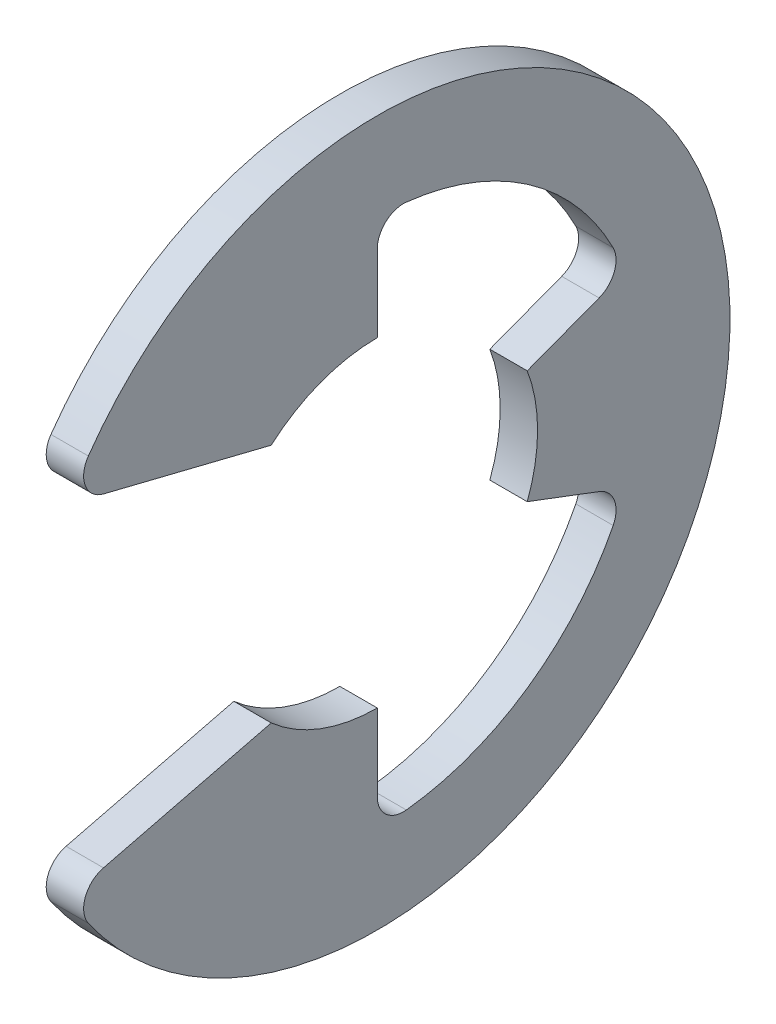
ISO-10303-21;
HEADER;
FILE_DESCRIPTION(('STEP AP214'),'2;1');
FILE_NAME('part.step','',(''),(''),'','','');
FILE_SCHEMA(('AUTOMOTIVE_DESIGN { 1 0 10303 214 1 1 1 1 }'));
ENDSEC;
DATA;
#1=APPLICATION_CONTEXT('core data for automotive mechanical design processes');
#2=APPLICATION_PROTOCOL_DEFINITION('international standard','automotive_design',2000,#1);
#3=PRODUCT_CONTEXT('',#1,'mechanical');
#4=PRODUCT('Part','Part','',(#3));
#5=PRODUCT_RELATED_PRODUCT_CATEGORY('part','',(#4));
#6=PRODUCT_DEFINITION_FORMATION('','',#4);
#7=PRODUCT_DEFINITION_CONTEXT('part definition',#1,'design');
#8=PRODUCT_DEFINITION('design','',#6,#7);
#9=PRODUCT_DEFINITION_SHAPE('','',#8);
#10=(LENGTH_UNIT() NAMED_UNIT(*) SI_UNIT(.MILLI.,.METRE.));
#11=(NAMED_UNIT(*) PLANE_ANGLE_UNIT() SI_UNIT($,.RADIAN.));
#12=(NAMED_UNIT(*) SI_UNIT($,.STERADIAN.) SOLID_ANGLE_UNIT());
#13=UNCERTAINTY_MEASURE_WITH_UNIT(LENGTH_MEASURE(1.E-05),#10,'distance_accuracy_value','');
#14=(GEOMETRIC_REPRESENTATION_CONTEXT(3) GLOBAL_UNCERTAINTY_ASSIGNED_CONTEXT((#13)) GLOBAL_UNIT_ASSIGNED_CONTEXT((#10,
#11,#12)) REPRESENTATION_CONTEXT('',''));
#15=CARTESIAN_POINT('',(0.,0.,0.));
#16=DIRECTION('',(0.,0.,1.));
#17=DIRECTION('',(1.,0.,0.));
#18=AXIS2_PLACEMENT_3D('',#15,#16,#17);
#19=CARTESIAN_POINT('',(-0.4445,0.,0.));
#20=DIRECTION('',(1.,0.,0.));
#21=DIRECTION('',(0.,0.,-1.));
#22=AXIS2_PLACEMENT_3D('',#19,#20,#21);
#23=PLANE('',#22);
#24=CARTESIAN_POINT('',(-0.4445,-4.45106931115285,6.35617228190939));
#25=DIRECTION('',(-1.,0.,0.));
#26=DIRECTION('',(0.,0.,1.));
#27=AXIS2_PLACEMENT_3D('',#24,#25,#26);
#28=CIRCLE('',#27,0.6223);
#29=CARTESIAN_POINT('',(-0.4445,-3.84710424189029,6.50611722217305));
#30=VERTEX_POINT('',#29);
#31=CARTESIAN_POINT('',(-0.4445,-4.80802904314384,6.86591441253715));
#32=VERTEX_POINT('',#31);
#33=EDGE_CURVE('E20',#30,#32,#28,.F.);
#34=ORIENTED_EDGE('',*,*,#33,.F.);
#35=DIRECTION('',(0.,0.240952820606873,-0.970536829925373));
#36=VECTOR('',#35,1.);
#37=CARTESIAN_POINT('',(-0.4445,-4.05333224143882,7.33678551823021));
#38=LINE('',#37,#36);
#39=CARTESIAN_POINT('',(-0.4445,-2.8575,2.52007812378902));
#40=VERTEX_POINT('',#39);
#41=EDGE_CURVE('E144',#30,#40,#38,.T.);
#42=ORIENTED_EDGE('',*,*,#41,.T.);
#43=CARTESIAN_POINT('',(-0.4445,0.,0.));
#44=DIRECTION('',(-1.,0.,0.));
#45=DIRECTION('',(0.,0.,1.));
#46=AXIS2_PLACEMENT_3D('',#43,#44,#45);
#47=CIRCLE('',#46,3.81);
#48=CARTESIAN_POINT('',(-0.4445,-3.81,0.));
#49=VERTEX_POINT('',#48);
#50=EDGE_CURVE('E222',#40,#49,#47,.F.);
#51=ORIENTED_EDGE('',*,*,#50,.T.);
#52=DIRECTION('',(0.,-1.,0.));
#53=VECTOR('',#52,1.);
#54=CARTESIAN_POINT('',(-0.4445,-3.81,0.));
#55=LINE('',#54,#53);
#56=CARTESIAN_POINT('',(-0.4445,-5.63609412254343,0.));
#57=VERTEX_POINT('',#56);
#58=EDGE_CURVE('E165',#49,#57,#55,.T.);
#59=ORIENTED_EDGE('',*,*,#58,.T.);
#60=CARTESIAN_POINT('',(-0.4445,-5.63609412254343,-0.622300000000001));
#61=DIRECTION('',(-1.,0.,0.));
#62=DIRECTION('',(0.,0.,1.));
#63=AXIS2_PLACEMENT_3D('',#60,#61,#62);
#64=CIRCLE('',#63,0.6223);
#65=CARTESIAN_POINT('',(-0.4445,-6.25463519415267,-0.690595188208945));
#66=VERTEX_POINT('',#65);
#67=EDGE_CURVE('E224',#57,#66,#64,.F.);
#68=ORIENTED_EDGE('',*,*,#67,.T.);
#69=CARTESIAN_POINT('',(-0.4445,0.,0.));
#70=DIRECTION('',(-1.,0.,0.));
#71=DIRECTION('',(0.,0.,1.));
#72=AXIS2_PLACEMENT_3D('',#69,#70,#71);
#73=CIRCLE('',#72,6.29264516129032);
#74=CARTESIAN_POINT('',(-0.4445,-2.85734012662483,-5.60651322362573));
#75=VERTEX_POINT('',#74);
#76=EDGE_CURVE('E226',#66,#75,#73,.F.);
#77=ORIENTED_EDGE('',*,*,#76,.T.);
#78=CARTESIAN_POINT('',(-0.4445,-2.57476853467541,-5.05206702657576));
#79=DIRECTION('',(-1.,0.,0.));
#80=DIRECTION('',(0.,0.,1.));
#81=AXIS2_PLACEMENT_3D('',#78,#79,#80);
#82=CIRCLE('',#81,0.6223);
#83=CARTESIAN_POINT('',(-0.4445,-1.99266018672805,-5.27208330154195));
#84=VERTEX_POINT('',#83);
#85=EDGE_CURVE('E172',#75,#84,#82,.F.);
#86=ORIENTED_EDGE('',*,*,#85,.T.);
#87=DIRECTION('',(0.,0.353553390593274,0.935414346693485));
#88=VECTOR('',#87,1.);
#89=CARTESIAN_POINT('',(-0.4445,-1.34703841816037,-3.56392866090218));
#90=LINE('',#89,#88);
#91=CARTESIAN_POINT('',(-0.4445,-1.34703841816037,-3.56392866090218));
#92=VERTEX_POINT('',#91);
#93=EDGE_CURVE('E169',#84,#92,#90,.T.);
#94=ORIENTED_EDGE('',*,*,#93,.T.);
#95=CARTESIAN_POINT('',(-0.4445,0.,0.));
#96=DIRECTION('',(-1.,0.,0.));
#97=DIRECTION('',(0.,0.,1.));
#98=AXIS2_PLACEMENT_3D('',#95,#96,#97);
#99=CIRCLE('',#98,3.81);
#100=CARTESIAN_POINT('',(-0.4445,1.34703841816037,-3.56392866090218));
#101=VERTEX_POINT('',#100);
#102=EDGE_CURVE('E232',#92,#101,#99,.F.);
#103=ORIENTED_EDGE('',*,*,#102,.T.);
#104=DIRECTION('',(0.,0.353553390593274,-0.935414346693485));
#105=VECTOR('',#104,1.);
#106=CARTESIAN_POINT('',(-0.4445,1.34703841816037,-3.56392866090218));
#107=LINE('',#106,#105);
#108=CARTESIAN_POINT('',(-0.4445,1.99266018672805,-5.27208330154195));
#109=VERTEX_POINT('',#108);
#110=EDGE_CURVE('E174',#101,#109,#107,.T.);
#111=ORIENTED_EDGE('',*,*,#110,.T.);
#112=CARTESIAN_POINT('',(-0.4445,2.57476853467541,-5.05206702657576));
#113=DIRECTION('',(-1.,0.,0.));
#114=DIRECTION('',(0.,0.,1.));
#115=AXIS2_PLACEMENT_3D('',#112,#113,#114);
#116=CIRCLE('',#115,0.6223);
#117=CARTESIAN_POINT('',(-0.4445,2.85734012662483,-5.60651322362572));
#118=VERTEX_POINT('',#117);
#119=EDGE_CURVE('E236',#109,#118,#116,.F.);
#120=ORIENTED_EDGE('',*,*,#119,.T.);
#121=CARTESIAN_POINT('',(-0.4445,0.,0.));
#122=DIRECTION('',(-1.,0.,0.));
#123=DIRECTION('',(0.,0.,1.));
#124=AXIS2_PLACEMENT_3D('',#121,#122,#123);
#125=CIRCLE('',#124,6.29264516129032);
#126=CARTESIAN_POINT('',(-0.4445,6.25463519415267,-0.690595188208944));
#127=VERTEX_POINT('',#126);
#128=EDGE_CURVE('E239',#118,#127,#125,.F.);
#129=ORIENTED_EDGE('',*,*,#128,.T.);
#130=CARTESIAN_POINT('',(-0.4445,5.63609412254343,-0.622299999999999));
#131=DIRECTION('',(-1.,0.,0.));
#132=DIRECTION('',(0.,0.,1.));
#133=AXIS2_PLACEMENT_3D('',#130,#131,#132);
#134=CIRCLE('',#133,0.6223);
#135=CARTESIAN_POINT('',(-0.4445,5.63609412254343,0.));
#136=VERTEX_POINT('',#135);
#137=EDGE_CURVE('E181',#127,#136,#134,.F.);
#138=ORIENTED_EDGE('',*,*,#137,.T.);
#139=DIRECTION('',(0.,-1.,0.));
#140=VECTOR('',#139,1.);
#141=CARTESIAN_POINT('',(-0.4445,3.81,0.));
#142=LINE('',#141,#140);
#143=CARTESIAN_POINT('',(-0.4445,3.81,0.));
#144=VERTEX_POINT('',#143);
#145=EDGE_CURVE('E178',#136,#144,#142,.T.);
#146=ORIENTED_EDGE('',*,*,#145,.T.);
#147=CARTESIAN_POINT('',(-0.4445,0.,0.));
#148=DIRECTION('',(-1.,0.,0.));
#149=DIRECTION('',(0.,0.,1.));
#150=AXIS2_PLACEMENT_3D('',#147,#148,#149);
#151=CIRCLE('',#150,3.81);
#152=CARTESIAN_POINT('',(-0.4445,2.8575,2.52007812378902));
#153=VERTEX_POINT('',#152);
#154=EDGE_CURVE('E243',#144,#153,#151,.F.);
#155=ORIENTED_EDGE('',*,*,#154,.T.);
#156=DIRECTION('',(0.,0.240952820606873,0.970536829925373));
#157=VECTOR('',#156,1.);
#158=CARTESIAN_POINT('',(-0.4445,4.05333224143882,7.33678551823021));
#159=LINE('',#158,#157);
#160=CARTESIAN_POINT('',(-0.4445,3.84710424189029,6.50611722217305));
#161=VERTEX_POINT('',#160);
#162=EDGE_CURVE('E183',#153,#161,#159,.T.);
#163=ORIENTED_EDGE('',*,*,#162,.T.);
#164=CARTESIAN_POINT('',(-0.4445,4.45106931115285,6.35617228190939));
#165=DIRECTION('',(-1.,0.,0.));
#166=DIRECTION('',(0.,0.,1.));
#167=AXIS2_PLACEMENT_3D('',#164,#165,#166);
#168=CIRCLE('',#167,0.6223);
#169=CARTESIAN_POINT('',(-0.4445,4.80802904314383,6.86591441253715));
#170=VERTEX_POINT('',#169);
#171=EDGE_CURVE('E185',#170,#161,#168,.F.);
#172=ORIENTED_EDGE('',*,*,#171,.F.);
#173=CARTESIAN_POINT('',(-0.4445,0.,0.));
#174=DIRECTION('',(-1.,0.,0.));
#175=DIRECTION('',(0.,0.,1.));
#176=AXIS2_PLACEMENT_3D('',#173,#174,#175);
#177=CIRCLE('',#176,8.382);
#178=EDGE_CURVE('E147',#32,#170,#177,.F.);
#179=ORIENTED_EDGE('',*,*,#178,.F.);
#180=EDGE_LOOP('',(#34,#42,#51,#59,#68,#77,#86,#94,#103,#111,#120,#129,#138,#146,#155,#163,#172,#179));
#181=FACE_BOUND('',#180,.T.);
#182=ADVANCED_FACE('F17',(#181),#23,.F.);
#183=CARTESIAN_POINT('',(0.4445,-4.05333224143882,7.33678551823021));
#184=DIRECTION('',(0.,-0.970536829925373,-0.240952820606873));
#185=DIRECTION('',(0.,0.240952820606873,-0.970536829925373));
#186=AXIS2_PLACEMENT_3D('',#183,#184,#185);
#187=PLANE('',#186);
#188=DIRECTION('',(-1.,0.,0.));
#189=VECTOR('',#188,1.);
#190=CARTESIAN_POINT('',(0.4445,-3.84710424189029,6.50611722217305));
#191=LINE('',#190,#189);
#192=CARTESIAN_POINT('',(0.4445,-3.84710424189029,6.50611722217305));
#193=VERTEX_POINT('',#192);
#194=EDGE_CURVE('E150',#193,#30,#191,.T.);
#195=ORIENTED_EDGE('',*,*,#194,.F.);
#196=DIRECTION('',(0.,-0.240952820606873,0.970536829925373));
#197=VECTOR('',#196,1.);
#198=CARTESIAN_POINT('',(0.4445,-2.8575,2.52007812378902));
#199=LINE('',#198,#197);
#200=CARTESIAN_POINT('',(0.4445,-2.8575,2.52007812378902));
#201=VERTEX_POINT('',#200);
#202=EDGE_CURVE('E221',#201,#193,#199,.T.);
#203=ORIENTED_EDGE('',*,*,#202,.F.);
#204=DIRECTION('',(-1.,0.,0.));
#205=VECTOR('',#204,1.);
#206=CARTESIAN_POINT('',(0.4445,-2.8575,2.52007812378902));
#207=LINE('',#206,#205);
#208=EDGE_CURVE('E155',#201,#40,#207,.T.);
#209=ORIENTED_EDGE('',*,*,#208,.T.);
#210=ORIENTED_EDGE('',*,*,#41,.F.);
#211=EDGE_LOOP('',(#195,#203,#209,#210));
#212=FACE_BOUND('',#211,.T.);
#213=ADVANCED_FACE('F152',(#212),#187,.F.);
#214=CARTESIAN_POINT('',(0.4445,-4.45106931115285,6.35617228190939));
#215=DIRECTION('',(-1.,0.,0.));
#216=DIRECTION('',(0.,0.,1.));
#217=AXIS2_PLACEMENT_3D('',#214,#215,#216);
#218=CYLINDRICAL_SURFACE('',#217,0.6223);
#219=ORIENTED_EDGE('',*,*,#33,.T.);
#220=DIRECTION('',(-1.,0.,0.));
#221=VECTOR('',#220,1.);
#222=CARTESIAN_POINT('',(0.4445,-4.80802904314384,6.86591441253715));
#223=LINE('',#222,#221);
#224=CARTESIAN_POINT('',(0.4445,-4.80802904314384,6.86591441253715));
#225=VERTEX_POINT('',#224);
#226=EDGE_CURVE('E149',#225,#32,#223,.T.);
#227=ORIENTED_EDGE('',*,*,#226,.F.);
#228=CARTESIAN_POINT('',(0.4445,-4.45106931115285,6.35617228190939));
#229=DIRECTION('',(-1.,0.,0.));
#230=DIRECTION('',(0.,0.,1.));
#231=AXIS2_PLACEMENT_3D('',#228,#229,#230);
#232=CIRCLE('',#231,0.6223);
#233=EDGE_CURVE('E159',#193,#225,#232,.F.);
#234=ORIENTED_EDGE('',*,*,#233,.F.);
#235=ORIENTED_EDGE('',*,*,#194,.T.);
#236=EDGE_LOOP('',(#219,#227,#234,#235));
#237=FACE_BOUND('',#236,.T.);
#238=ADVANCED_FACE('F158',(#237),#218,.T.);
#239=CARTESIAN_POINT('',(0.4445,0.,0.));
#240=DIRECTION('',(-1.,0.,0.));
#241=DIRECTION('',(0.,0.,1.));
#242=AXIS2_PLACEMENT_3D('',#239,#240,#241);
#243=CYLINDRICAL_SURFACE('',#242,8.382);
#244=ORIENTED_EDGE('',*,*,#178,.T.);
#245=DIRECTION('',(-1.,0.,0.));
#246=VECTOR('',#245,1.);
#247=CARTESIAN_POINT('',(0.4445,4.80802904314383,6.86591441253715));
#248=LINE('',#247,#246);
#249=CARTESIAN_POINT('',(0.4445,4.80802904314383,6.86591441253715));
#250=VERTEX_POINT('',#249);
#251=EDGE_CURVE('E248',#250,#170,#248,.T.);
#252=ORIENTED_EDGE('',*,*,#251,.F.);
#253=CARTESIAN_POINT('',(0.4445,0.,0.));
#254=DIRECTION('',(-1.,0.,0.));
#255=DIRECTION('',(0.,0.,1.));
#256=AXIS2_PLACEMENT_3D('',#253,#254,#255);
#257=CIRCLE('',#256,8.382);
#258=EDGE_CURVE('E217',#225,#250,#257,.F.);
#259=ORIENTED_EDGE('',*,*,#258,.F.);
#260=ORIENTED_EDGE('',*,*,#226,.T.);
#261=EDGE_LOOP('',(#244,#252,#259,#260));
#262=FACE_BOUND('',#261,.T.);
#263=ADVANCED_FACE('F252',(#262),#243,.T.);
#264=CARTESIAN_POINT('',(0.4445,4.45106931115285,6.35617228190939));
#265=DIRECTION('',(-1.,0.,0.));
#266=DIRECTION('',(0.,0.,1.));
#267=AXIS2_PLACEMENT_3D('',#264,#265,#266);
#268=CYLINDRICAL_SURFACE('',#267,0.6223);
#269=ORIENTED_EDGE('',*,*,#171,.T.);
#270=DIRECTION('',(1.,0.,0.));
#271=VECTOR('',#270,1.);
#272=CARTESIAN_POINT('',(0.4445,3.84710424189029,6.50611722217305));
#273=LINE('',#272,#271);
#274=CARTESIAN_POINT('',(0.4445,3.84710424189029,6.50611722217305));
#275=VERTEX_POINT('',#274);
#276=EDGE_CURVE('E184',#161,#275,#273,.T.);
#277=ORIENTED_EDGE('',*,*,#276,.T.);
#278=CARTESIAN_POINT('',(0.4445,4.45106931115285,6.35617228190939));
#279=DIRECTION('',(-1.,0.,0.));
#280=DIRECTION('',(0.,0.,1.));
#281=AXIS2_PLACEMENT_3D('',#278,#279,#280);
#282=CIRCLE('',#281,0.6223);
#283=EDGE_CURVE('E215',#250,#275,#282,.F.);
#284=ORIENTED_EDGE('',*,*,#283,.F.);
#285=ORIENTED_EDGE('',*,*,#251,.T.);
#286=EDGE_LOOP('',(#269,#277,#284,#285));
#287=FACE_BOUND('',#286,.T.);
#288=ADVANCED_FACE('F280',(#287),#268,.T.);
#289=CARTESIAN_POINT('',(0.4445,4.05333224143882,7.33678551823021));
#290=DIRECTION('',(0.,0.970536829925373,-0.240952820606873));
#291=DIRECTION('',(0.,0.240952820606873,0.970536829925373));
#292=AXIS2_PLACEMENT_3D('',#289,#290,#291);
#293=PLANE('',#292);
#294=ORIENTED_EDGE('',*,*,#276,.F.);
#295=ORIENTED_EDGE('',*,*,#162,.F.);
#296=DIRECTION('',(-1.,0.,0.));
#297=VECTOR('',#296,1.);
#298=CARTESIAN_POINT('',(0.4445,2.8575,2.52007812378902));
#299=LINE('',#298,#297);
#300=CARTESIAN_POINT('',(0.4445,2.8575,2.52007812378902));
#301=VERTEX_POINT('',#300);
#302=EDGE_CURVE('E246',#153,#301,#299,.F.);
#303=ORIENTED_EDGE('',*,*,#302,.T.);
#304=DIRECTION('',(0.,-0.240952820606873,-0.970536829925373));
#305=VECTOR('',#304,1.);
#306=CARTESIAN_POINT('',(0.4445,3.84710424189029,6.50611722217305));
#307=LINE('',#306,#305);
#308=EDGE_CURVE('E214',#275,#301,#307,.T.);
#309=ORIENTED_EDGE('',*,*,#308,.F.);
#310=EDGE_LOOP('',(#294,#295,#303,#309));
#311=FACE_BOUND('',#310,.T.);
#312=ADVANCED_FACE('F282',(#311),#293,.F.);
#313=CARTESIAN_POINT('',(0.4445,0.,0.));
#314=DIRECTION('',(-1.,0.,0.));
#315=DIRECTION('',(0.,0.,1.));
#316=AXIS2_PLACEMENT_3D('',#313,#314,#315);
#317=CYLINDRICAL_SURFACE('',#316,3.81);
#318=DIRECTION('',(1.,0.,0.));
#319=VECTOR('',#318,1.);
#320=CARTESIAN_POINT('',(0.4445,3.81,0.));
#321=LINE('',#320,#319);
#322=CARTESIAN_POINT('',(0.4445,3.81,0.));
#323=VERTEX_POINT('',#322);
#324=EDGE_CURVE('E182',#144,#323,#321,.T.);
#325=ORIENTED_EDGE('',*,*,#324,.T.);
#326=CARTESIAN_POINT('',(0.4445,0.,0.));
#327=DIRECTION('',(-1.,0.,0.));
#328=DIRECTION('',(0.,0.,1.));
#329=AXIS2_PLACEMENT_3D('',#326,#327,#328);
#330=CIRCLE('',#329,3.81);
#331=EDGE_CURVE('E211',#301,#323,#330,.T.);
#332=ORIENTED_EDGE('',*,*,#331,.F.);
#333=ORIENTED_EDGE('',*,*,#302,.F.);
#334=ORIENTED_EDGE('',*,*,#154,.F.);
#335=EDGE_LOOP('',(#325,#332,#333,#334));
#336=FACE_BOUND('',#335,.T.);
#337=ADVANCED_FACE('F288',(#336),#317,.F.);
#338=CARTESIAN_POINT('',(0.4445,3.81,0.));
#339=DIRECTION('',(0.,0.,1.));
#340=DIRECTION('',(0.,-1.,0.));
#341=AXIS2_PLACEMENT_3D('',#338,#339,#340);
#342=PLANE('',#341);
#343=DIRECTION('',(-1.,0.,0.));
#344=VECTOR('',#343,1.);
#345=CARTESIAN_POINT('',(0.4445,5.63609412254343,0.));
#346=LINE('',#345,#344);
#347=CARTESIAN_POINT('',(0.4445,5.63609412254343,0.));
#348=VERTEX_POINT('',#347);
#349=EDGE_CURVE('E241',#136,#348,#346,.F.);
#350=ORIENTED_EDGE('',*,*,#349,.T.);
#351=DIRECTION('',(0.,1.,0.));
#352=VECTOR('',#351,1.);
#353=CARTESIAN_POINT('',(0.4445,0.,0.));
#354=LINE('',#353,#352);
#355=EDGE_CURVE('E210',#323,#348,#354,.T.);
#356=ORIENTED_EDGE('',*,*,#355,.F.);
#357=ORIENTED_EDGE('',*,*,#324,.F.);
#358=ORIENTED_EDGE('',*,*,#145,.F.);
#359=EDGE_LOOP('',(#350,#356,#357,#358));
#360=FACE_BOUND('',#359,.T.);
#361=ADVANCED_FACE('F292',(#360),#342,.F.);
#362=CARTESIAN_POINT('',(0.4445,5.63609412254343,-0.622299999999999));
#363=DIRECTION('',(-1.,0.,0.));
#364=DIRECTION('',(0.,0.,1.));
#365=AXIS2_PLACEMENT_3D('',#362,#363,#364);
#366=CYLINDRICAL_SURFACE('',#365,0.6223);
#367=ORIENTED_EDGE('',*,*,#349,.F.);
#368=ORIENTED_EDGE('',*,*,#137,.F.);
#369=DIRECTION('',(-1.,0.,0.));
#370=VECTOR('',#369,1.);
#371=CARTESIAN_POINT('',(0.4445,6.25463519415267,-0.690595188208944));
#372=LINE('',#371,#370);
#373=CARTESIAN_POINT('',(0.4445,6.25463519415267,-0.690595188208944));
#374=VERTEX_POINT('',#373);
#375=EDGE_CURVE('E238',#127,#374,#372,.F.);
#376=ORIENTED_EDGE('',*,*,#375,.T.);
#377=CARTESIAN_POINT('',(0.4445,5.63609412254343,-0.622299999999999));
#378=DIRECTION('',(-1.,0.,0.));
#379=DIRECTION('',(0.,0.,1.));
#380=AXIS2_PLACEMENT_3D('',#377,#378,#379);
#381=CIRCLE('',#380,0.6223);
#382=EDGE_CURVE('E207',#348,#374,#381,.T.);
#383=ORIENTED_EDGE('',*,*,#382,.F.);
#384=EDGE_LOOP('',(#367,#368,#376,#383));
#385=FACE_BOUND('',#384,.T.);
#386=ADVANCED_FACE('F341',(#385),#366,.F.);
#387=CARTESIAN_POINT('',(0.4445,0.,0.));
#388=DIRECTION('',(-1.,0.,0.));
#389=DIRECTION('',(0.,0.,1.));
#390=AXIS2_PLACEMENT_3D('',#387,#388,#389);
#391=CYLINDRICAL_SURFACE('',#390,6.29264516129032);
#392=ORIENTED_EDGE('',*,*,#375,.F.);
#393=ORIENTED_EDGE('',*,*,#128,.F.);
#394=DIRECTION('',(-1.,0.,0.));
#395=VECTOR('',#394,1.);
#396=CARTESIAN_POINT('',(0.4445,2.85734012662483,-5.60651322362572));
#397=LINE('',#396,#395);
#398=CARTESIAN_POINT('',(0.4445,2.85734012662483,-5.60651322362572));
#399=VERTEX_POINT('',#398);
#400=EDGE_CURVE('E177',#118,#399,#397,.F.);
#401=ORIENTED_EDGE('',*,*,#400,.T.);
#402=CARTESIAN_POINT('',(0.4445,0.,0.));
#403=DIRECTION('',(-1.,0.,0.));
#404=DIRECTION('',(0.,0.,1.));
#405=AXIS2_PLACEMENT_3D('',#402,#403,#404);
#406=CIRCLE('',#405,6.29264516129032);
#407=EDGE_CURVE('E204',#374,#399,#406,.T.);
#408=ORIENTED_EDGE('',*,*,#407,.F.);
#409=EDGE_LOOP('',(#392,#393,#401,#408));
#410=FACE_BOUND('',#409,.T.);
#411=ADVANCED_FACE('F338',(#410),#391,.F.);
#412=CARTESIAN_POINT('',(0.4445,2.57476853467541,-5.05206702657576));
#413=DIRECTION('',(-1.,0.,0.));
#414=DIRECTION('',(0.,0.,1.));
#415=AXIS2_PLACEMENT_3D('',#412,#413,#414);
#416=CYLINDRICAL_SURFACE('',#415,0.6223);
#417=ORIENTED_EDGE('',*,*,#400,.F.);
#418=ORIENTED_EDGE('',*,*,#119,.F.);
#419=DIRECTION('',(1.,0.,0.));
#420=VECTOR('',#419,1.);
#421=CARTESIAN_POINT('',(0.4445,1.99266018672805,-5.27208330154195));
#422=LINE('',#421,#420);
#423=CARTESIAN_POINT('',(0.4445,1.99266018672805,-5.27208330154195));
#424=VERTEX_POINT('',#423);
#425=EDGE_CURVE('E176',#109,#424,#422,.T.);
#426=ORIENTED_EDGE('',*,*,#425,.T.);
#427=CARTESIAN_POINT('',(0.4445,2.57476853467541,-5.05206702657576));
#428=DIRECTION('',(-1.,0.,0.));
#429=DIRECTION('',(0.,0.,1.));
#430=AXIS2_PLACEMENT_3D('',#427,#428,#429);
#431=CIRCLE('',#430,0.6223);
#432=EDGE_CURVE('E201',#399,#424,#431,.T.);
#433=ORIENTED_EDGE('',*,*,#432,.F.);
#434=EDGE_LOOP('',(#417,#418,#426,#433));
#435=FACE_BOUND('',#434,.T.);
#436=ADVANCED_FACE('F331',(#435),#416,.F.);
#437=CARTESIAN_POINT('',(0.4445,1.34703841816037,-3.56392866090218));
#438=DIRECTION('',(0.,-0.935414346693485,-0.353553390593274));
#439=DIRECTION('',(0.,0.353553390593274,-0.935414346693485));
#440=AXIS2_PLACEMENT_3D('',#437,#438,#439);
#441=PLANE('',#440);
#442=ORIENTED_EDGE('',*,*,#425,.F.);
#443=ORIENTED_EDGE('',*,*,#110,.F.);
#444=DIRECTION('',(-1.,0.,0.));
#445=VECTOR('',#444,1.);
#446=CARTESIAN_POINT('',(0.4445,1.34703841816037,-3.56392866090218));
#447=LINE('',#446,#445);
#448=CARTESIAN_POINT('',(0.4445,1.34703841816037,-3.56392866090218));
#449=VERTEX_POINT('',#448);
#450=EDGE_CURVE('E235',#101,#449,#447,.F.);
#451=ORIENTED_EDGE('',*,*,#450,.T.);
#452=DIRECTION('',(0.,-0.353553390593274,0.935414346693485));
#453=VECTOR('',#452,1.);
#454=CARTESIAN_POINT('',(0.4445,1.99266018672805,-5.27208330154195));
#455=LINE('',#454,#453);
#456=EDGE_CURVE('E200',#424,#449,#455,.T.);
#457=ORIENTED_EDGE('',*,*,#456,.F.);
#458=EDGE_LOOP('',(#442,#443,#451,#457));
#459=FACE_BOUND('',#458,.T.);
#460=ADVANCED_FACE('F334',(#459),#441,.F.);
#461=CARTESIAN_POINT('',(0.4445,0.,0.));
#462=DIRECTION('',(-1.,0.,0.));
#463=DIRECTION('',(0.,0.,1.));
#464=AXIS2_PLACEMENT_3D('',#461,#462,#463);
#465=CYLINDRICAL_SURFACE('',#464,3.81);
#466=DIRECTION('',(1.,0.,0.));
#467=VECTOR('',#466,1.);
#468=CARTESIAN_POINT('',(0.4445,-1.34703841816037,-3.56392866090218));
#469=LINE('',#468,#467);
#470=CARTESIAN_POINT('',(0.4445,-1.34703841816037,-3.56392866090218));
#471=VERTEX_POINT('',#470);
#472=EDGE_CURVE('E173',#92,#471,#469,.T.);
#473=ORIENTED_EDGE('',*,*,#472,.T.);
#474=CARTESIAN_POINT('',(0.4445,0.,0.));
#475=DIRECTION('',(-1.,0.,0.));
#476=DIRECTION('',(0.,0.,1.));
#477=AXIS2_PLACEMENT_3D('',#474,#475,#476);
#478=CIRCLE('',#477,3.81);
#479=EDGE_CURVE('E197',#449,#471,#478,.T.);
#480=ORIENTED_EDGE('',*,*,#479,.F.);
#481=ORIENTED_EDGE('',*,*,#450,.F.);
#482=ORIENTED_EDGE('',*,*,#102,.F.);
#483=EDGE_LOOP('',(#473,#480,#481,#482));
#484=FACE_BOUND('',#483,.T.);
#485=ADVANCED_FACE('F323',(#484),#465,.F.);
#486=CARTESIAN_POINT('',(0.4445,-1.34703841816037,-3.56392866090218));
#487=DIRECTION('',(0.,0.935414346693485,-0.353553390593274));
#488=DIRECTION('',(0.,0.353553390593274,0.935414346693485));
#489=AXIS2_PLACEMENT_3D('',#486,#487,#488);
#490=PLANE('',#489);
#491=DIRECTION('',(-1.,0.,0.));
#492=VECTOR('',#491,1.);
#493=CARTESIAN_POINT('',(0.4445,-1.99266018672805,-5.27208330154195));
#494=LINE('',#493,#492);
#495=CARTESIAN_POINT('',(0.4445,-1.99266018672805,-5.27208330154195));
#496=VERTEX_POINT('',#495);
#497=EDGE_CURVE('E231',#84,#496,#494,.F.);
#498=ORIENTED_EDGE('',*,*,#497,.T.);
#499=DIRECTION('',(0.,-0.353553390593274,-0.935414346693485));
#500=VECTOR('',#499,1.);
#501=CARTESIAN_POINT('',(0.4445,-1.34703841816037,-3.56392866090218));
#502=LINE('',#501,#500);
#503=EDGE_CURVE('E196',#471,#496,#502,.T.);
#504=ORIENTED_EDGE('',*,*,#503,.F.);
#505=ORIENTED_EDGE('',*,*,#472,.F.);
#506=ORIENTED_EDGE('',*,*,#93,.F.);
#507=EDGE_LOOP('',(#498,#504,#505,#506));
#508=FACE_BOUND('',#507,.T.);
#509=ADVANCED_FACE('F319',(#508),#490,.F.);
#510=CARTESIAN_POINT('',(0.4445,-2.57476853467541,-5.05206702657576));
#511=DIRECTION('',(-1.,0.,0.));
#512=DIRECTION('',(0.,0.,1.));
#513=AXIS2_PLACEMENT_3D('',#510,#511,#512);
#514=CYLINDRICAL_SURFACE('',#513,0.6223);
#515=ORIENTED_EDGE('',*,*,#497,.F.);
#516=ORIENTED_EDGE('',*,*,#85,.F.);
#517=DIRECTION('',(-1.,0.,0.));
#518=VECTOR('',#517,1.);
#519=CARTESIAN_POINT('',(0.4445,-2.85734012662483,-5.60651322362573));
#520=LINE('',#519,#518);
#521=CARTESIAN_POINT('',(0.4445,-2.85734012662483,-5.60651322362573));
#522=VERTEX_POINT('',#521);
#523=EDGE_CURVE('E229',#75,#522,#520,.F.);
#524=ORIENTED_EDGE('',*,*,#523,.T.);
#525=CARTESIAN_POINT('',(0.4445,-2.57476853467541,-5.05206702657576));
#526=DIRECTION('',(-1.,0.,0.));
#527=DIRECTION('',(0.,0.,1.));
#528=AXIS2_PLACEMENT_3D('',#525,#526,#527);
#529=CIRCLE('',#528,0.6223);
#530=EDGE_CURVE('E193',#496,#522,#529,.T.);
#531=ORIENTED_EDGE('',*,*,#530,.F.);
#532=EDGE_LOOP('',(#515,#516,#524,#531));
#533=FACE_BOUND('',#532,.T.);
#534=ADVANCED_FACE('F315',(#533),#514,.F.);
#535=CARTESIAN_POINT('',(0.4445,0.,0.));
#536=DIRECTION('',(-1.,0.,0.));
#537=DIRECTION('',(0.,0.,1.));
#538=AXIS2_PLACEMENT_3D('',#535,#536,#537);
#539=CYLINDRICAL_SURFACE('',#538,6.29264516129032);
#540=DIRECTION('',(-1.,0.,0.));
#541=VECTOR('',#540,1.);
#542=CARTESIAN_POINT('',(0.4445,-6.25463519415267,-0.690595188208945));
#543=LINE('',#542,#541);
#544=CARTESIAN_POINT('',(0.4445,-6.25463519415267,-0.690595188208945));
#545=VERTEX_POINT('',#544);
#546=EDGE_CURVE('E168',#66,#545,#543,.F.);
#547=ORIENTED_EDGE('',*,*,#546,.T.);
#548=CARTESIAN_POINT('',(0.4445,0.,0.));
#549=DIRECTION('',(-1.,0.,0.));
#550=DIRECTION('',(0.,0.,1.));
#551=AXIS2_PLACEMENT_3D('',#548,#549,#550);
#552=CIRCLE('',#551,6.29264516129032);
#553=EDGE_CURVE('E190',#522,#545,#552,.T.);
#554=ORIENTED_EDGE('',*,*,#553,.F.);
#555=ORIENTED_EDGE('',*,*,#523,.F.);
#556=ORIENTED_EDGE('',*,*,#76,.F.);
#557=EDGE_LOOP('',(#547,#554,#555,#556));
#558=FACE_BOUND('',#557,.T.);
#559=ADVANCED_FACE('F310',(#558),#539,.F.);
#560=CARTESIAN_POINT('',(0.4445,-5.63609412254343,-0.622300000000001));
#561=DIRECTION('',(-1.,0.,0.));
#562=DIRECTION('',(0.,0.,1.));
#563=AXIS2_PLACEMENT_3D('',#560,#561,#562);
#564=CYLINDRICAL_SURFACE('',#563,0.6223);
#565=ORIENTED_EDGE('',*,*,#546,.F.);
#566=ORIENTED_EDGE('',*,*,#67,.F.);
#567=DIRECTION('',(1.,0.,0.));
#568=VECTOR('',#567,1.);
#569=CARTESIAN_POINT('',(0.4445,-5.63609412254343,0.));
#570=LINE('',#569,#568);
#571=CARTESIAN_POINT('',(0.4445,-5.63609412254343,0.));
#572=VERTEX_POINT('',#571);
#573=EDGE_CURVE('E167',#57,#572,#570,.T.);
#574=ORIENTED_EDGE('',*,*,#573,.T.);
#575=CARTESIAN_POINT('',(0.4445,-5.63609412254343,-0.622300000000001));
#576=DIRECTION('',(-1.,0.,0.));
#577=DIRECTION('',(0.,0.,1.));
#578=AXIS2_PLACEMENT_3D('',#575,#576,#577);
#579=CIRCLE('',#578,0.6223);
#580=EDGE_CURVE('E187',#545,#572,#579,.T.);
#581=ORIENTED_EDGE('',*,*,#580,.F.);
#582=EDGE_LOOP('',(#565,#566,#574,#581));
#583=FACE_BOUND('',#582,.T.);
#584=ADVANCED_FACE('F306',(#583),#564,.F.);
#585=CARTESIAN_POINT('',(0.4445,-3.81,0.));
#586=DIRECTION('',(0.,0.,1.));
#587=DIRECTION('',(0.,-1.,0.));
#588=AXIS2_PLACEMENT_3D('',#585,#586,#587);
#589=PLANE('',#588);
#590=ORIENTED_EDGE('',*,*,#573,.F.);
#591=ORIENTED_EDGE('',*,*,#58,.F.);
#592=DIRECTION('',(-1.,0.,0.));
#593=VECTOR('',#592,1.);
#594=CARTESIAN_POINT('',(0.4445,-3.81,0.));
#595=LINE('',#594,#593);
#596=CARTESIAN_POINT('',(0.4445,-3.81,0.));
#597=VERTEX_POINT('',#596);
#598=EDGE_CURVE('E35',#49,#597,#595,.F.);
#599=ORIENTED_EDGE('',*,*,#598,.T.);
#600=DIRECTION('',(0.,1.,0.));
#601=VECTOR('',#600,1.);
#602=CARTESIAN_POINT('',(0.4445,0.,0.));
#603=LINE('',#602,#601);
#604=EDGE_CURVE('E26',#572,#597,#603,.T.);
#605=ORIENTED_EDGE('',*,*,#604,.F.);
#606=EDGE_LOOP('',(#590,#591,#599,#605));
#607=FACE_BOUND('',#606,.T.);
#608=ADVANCED_FACE('F302',(#607),#589,.F.);
#609=CARTESIAN_POINT('',(0.4445,0.,0.));
#610=DIRECTION('',(-1.,0.,0.));
#611=DIRECTION('',(0.,0.,1.));
#612=AXIS2_PLACEMENT_3D('',#609,#610,#611);
#613=CYLINDRICAL_SURFACE('',#612,3.81);
#614=ORIENTED_EDGE('',*,*,#208,.F.);
#615=CARTESIAN_POINT('',(0.4445,0.,0.));
#616=DIRECTION('',(-1.,0.,0.));
#617=DIRECTION('',(0.,0.,1.));
#618=AXIS2_PLACEMENT_3D('',#615,#616,#617);
#619=CIRCLE('',#618,3.81);
#620=EDGE_CURVE('E11',#597,#201,#619,.T.);
#621=ORIENTED_EDGE('',*,*,#620,.F.);
#622=ORIENTED_EDGE('',*,*,#598,.F.);
#623=ORIENTED_EDGE('',*,*,#50,.F.);
#624=EDGE_LOOP('',(#614,#621,#622,#623));
#625=FACE_BOUND('',#624,.T.);
#626=ADVANCED_FACE('F352',(#625),#613,.F.);
#627=CARTESIAN_POINT('',(0.4445,0.,0.));
#628=DIRECTION('',(1.,0.,0.));
#629=DIRECTION('',(0.,0.,-1.));
#630=AXIS2_PLACEMENT_3D('',#627,#628,#629);
#631=PLANE('',#630);
#632=ORIENTED_EDGE('',*,*,#604,.T.);
#633=ORIENTED_EDGE('',*,*,#620,.T.);
#634=ORIENTED_EDGE('',*,*,#202,.T.);
#635=ORIENTED_EDGE('',*,*,#233,.T.);
#636=ORIENTED_EDGE('',*,*,#258,.T.);
#637=ORIENTED_EDGE('',*,*,#283,.T.);
#638=ORIENTED_EDGE('',*,*,#308,.T.);
#639=ORIENTED_EDGE('',*,*,#331,.T.);
#640=ORIENTED_EDGE('',*,*,#355,.T.);
#641=ORIENTED_EDGE('',*,*,#382,.T.);
#642=ORIENTED_EDGE('',*,*,#407,.T.);
#643=ORIENTED_EDGE('',*,*,#432,.T.);
#644=ORIENTED_EDGE('',*,*,#456,.T.);
#645=ORIENTED_EDGE('',*,*,#479,.T.);
#646=ORIENTED_EDGE('',*,*,#503,.T.);
#647=ORIENTED_EDGE('',*,*,#530,.T.);
#648=ORIENTED_EDGE('',*,*,#553,.T.);
#649=ORIENTED_EDGE('',*,*,#580,.T.);
#650=EDGE_LOOP('',(#632,#633,#634,#635,#636,#637,#638,#639,#640,#641,#642,#643,#644,#645,#646,
#647,#648,#649));
#651=FACE_BOUND('',#650,.T.);
#652=ADVANCED_FACE('F256',(#651),#631,.T.);
#653=CLOSED_SHELL('',(#182,#213,#238,#263,#288,#312,#337,#361,#386,#411,#436,#460,#485,#509,
#534,#559,#584,#608,#626,#652));
#654=MANIFOLD_SOLID_BREP('B1',#653);
#655=ADVANCED_BREP_SHAPE_REPRESENTATION('',(#18,#654),#14);
#656=SHAPE_DEFINITION_REPRESENTATION(#9,#655);
ENDSEC;
END-ISO-10303-21;
